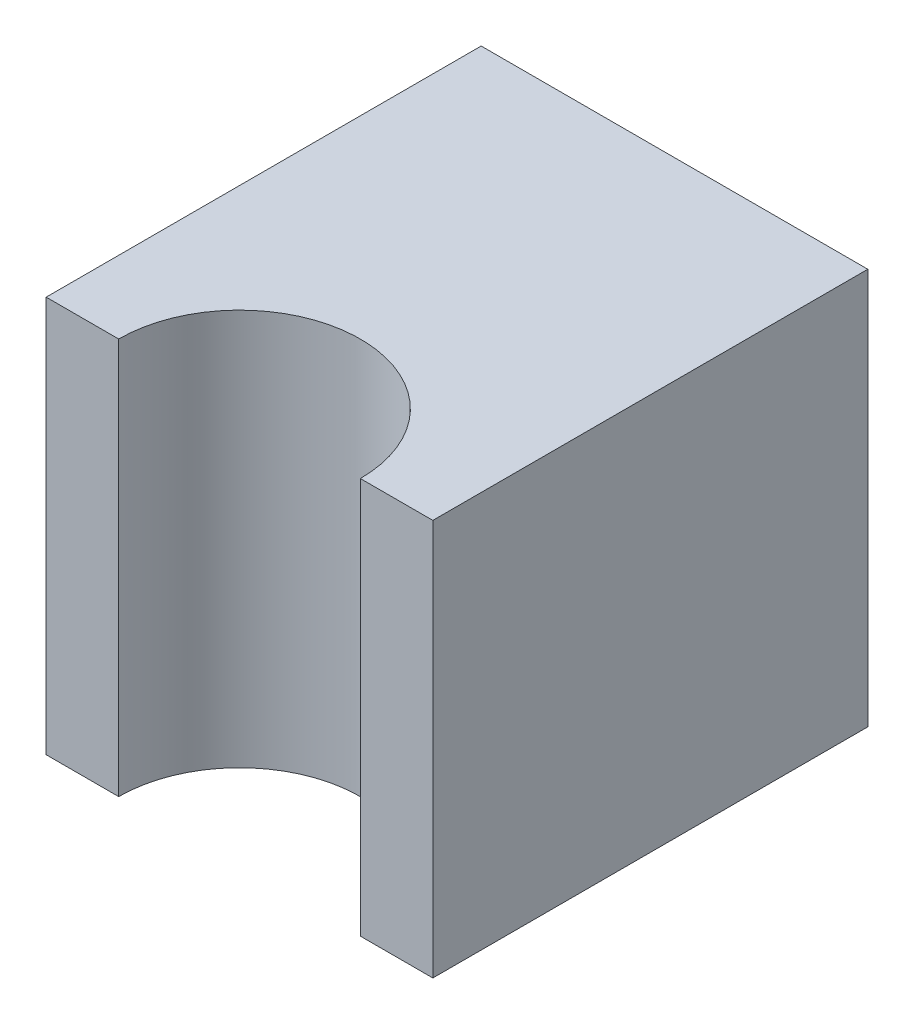
ISO-10303-21;
HEADER;
FILE_DESCRIPTION(('STEP AP214'),'2;1');
FILE_NAME('part.step','',(''),(''),'','','');
FILE_SCHEMA(('AUTOMOTIVE_DESIGN { 1 0 10303 214 1 1 1 1 }'));
ENDSEC;
DATA;
#1=APPLICATION_CONTEXT('core data for automotive mechanical design processes');
#2=APPLICATION_PROTOCOL_DEFINITION('international standard','automotive_design',2000,#1);
#3=PRODUCT_CONTEXT('',#1,'mechanical');
#4=PRODUCT('Part','Part','',(#3));
#5=PRODUCT_RELATED_PRODUCT_CATEGORY('part','',(#4));
#6=PRODUCT_DEFINITION_FORMATION('','',#4);
#7=PRODUCT_DEFINITION_CONTEXT('part definition',#1,'design');
#8=PRODUCT_DEFINITION('design','',#6,#7);
#9=PRODUCT_DEFINITION_SHAPE('','',#8);
#10=(LENGTH_UNIT() NAMED_UNIT(*) SI_UNIT(.MILLI.,.METRE.));
#11=(NAMED_UNIT(*) PLANE_ANGLE_UNIT() SI_UNIT($,.RADIAN.));
#12=(NAMED_UNIT(*) SI_UNIT($,.STERADIAN.) SOLID_ANGLE_UNIT());
#13=UNCERTAINTY_MEASURE_WITH_UNIT(LENGTH_MEASURE(1.E-05),#10,'distance_accuracy_value','');
#14=(GEOMETRIC_REPRESENTATION_CONTEXT(3) GLOBAL_UNCERTAINTY_ASSIGNED_CONTEXT((#13)) GLOBAL_UNIT_ASSIGNED_CONTEXT((#10,
#11,#12)) REPRESENTATION_CONTEXT('',''));
#15=CARTESIAN_POINT('',(0.,0.,0.));
#16=DIRECTION('',(0.,0.,1.));
#17=DIRECTION('',(1.,0.,0.));
#18=AXIS2_PLACEMENT_3D('',#15,#16,#17);
#19=CARTESIAN_POINT('',(-2.6,0.,6.1));
#20=DIRECTION('',(0.,1.,0.));
#21=DIRECTION('',(0.,0.,1.));
#22=AXIS2_PLACEMENT_3D('',#19,#20,#21);
#23=CYLINDRICAL_SURFACE('',#22,0.25);
#24=DIRECTION('',(0.,1.,0.));
#25=VECTOR('',#24,1.);
#26=CARTESIAN_POINT('',(-2.35,0.,6.1));
#27=LINE('',#26,#25);
#28=CARTESIAN_POINT('',(-2.35,0.82,6.1));
#29=VERTEX_POINT('',#28);
#30=CARTESIAN_POINT('',(-2.35,0.,6.1));
#31=VERTEX_POINT('',#30);
#32=EDGE_CURVE('E119',#29,#31,#27,.F.);
#33=ORIENTED_EDGE('',*,*,#32,.F.);
#34=CARTESIAN_POINT('',(-2.6,0.82,6.1));
#35=DIRECTION('',(0.,1.,0.));
#36=DIRECTION('',(0.,0.,1.));
#37=AXIS2_PLACEMENT_3D('',#34,#35,#36);
#38=CIRCLE('',#37,0.25);
#39=CARTESIAN_POINT('',(-2.85,0.82,6.1));
#40=VERTEX_POINT('',#39);
#41=EDGE_CURVE('E80',#40,#29,#38,.F.);
#42=ORIENTED_EDGE('',*,*,#41,.F.);
#43=DIRECTION('',(0.,1.,0.));
#44=VECTOR('',#43,1.);
#45=CARTESIAN_POINT('',(-2.85,0.,6.1));
#46=LINE('',#45,#44);
#47=CARTESIAN_POINT('',(-2.85,0.,6.1));
#48=VERTEX_POINT('',#47);
#49=EDGE_CURVE('E78',#48,#40,#46,.T.);
#50=ORIENTED_EDGE('',*,*,#49,.F.);
#51=CARTESIAN_POINT('',(-2.6,0.,6.1));
#52=DIRECTION('',(0.,1.,0.));
#53=DIRECTION('',(0.,0.,1.));
#54=AXIS2_PLACEMENT_3D('',#51,#52,#53);
#55=CIRCLE('',#54,0.25);
#56=EDGE_CURVE('E20',#48,#31,#55,.F.);
#57=ORIENTED_EDGE('',*,*,#56,.T.);
#58=EDGE_LOOP('',(#33,#42,#50,#57));
#59=FACE_BOUND('',#58,.T.);
#60=ADVANCED_FACE('F17',(#59),#23,.F.);
#61=CARTESIAN_POINT('',(-2.35,0.,6.1));
#62=DIRECTION('',(0.,0.,1.));
#63=DIRECTION('',(1.,0.,0.));
#64=AXIS2_PLACEMENT_3D('',#61,#62,#63);
#65=PLANE('',#64);
#66=DIRECTION('',(1.,0.,0.));
#67=VECTOR('',#66,1.);
#68=CARTESIAN_POINT('',(-2.6,0.82,6.1));
#69=LINE('',#68,#67);
#70=CARTESIAN_POINT('',(-2.2,0.82,6.1));
#71=VERTEX_POINT('',#70);
#72=EDGE_CURVE('E104',#29,#71,#69,.T.);
#73=ORIENTED_EDGE('',*,*,#72,.F.);
#74=ORIENTED_EDGE('',*,*,#32,.T.);
#75=DIRECTION('',(1.,0.,0.));
#76=VECTOR('',#75,1.);
#77=CARTESIAN_POINT('',(-2.6,0.,6.1));
#78=LINE('',#77,#76);
#79=CARTESIAN_POINT('',(-2.2,0.,6.1));
#80=VERTEX_POINT('',#79);
#81=EDGE_CURVE('E73',#31,#80,#78,.T.);
#82=ORIENTED_EDGE('',*,*,#81,.T.);
#83=DIRECTION('',(0.,1.,0.));
#84=VECTOR('',#83,1.);
#85=CARTESIAN_POINT('',(-2.2,0.,6.1));
#86=LINE('',#85,#84);
#87=EDGE_CURVE('E76',#71,#80,#86,.F.);
#88=ORIENTED_EDGE('',*,*,#87,.F.);
#89=EDGE_LOOP('',(#73,#74,#82,#88));
#90=FACE_BOUND('',#89,.T.);
#91=ADVANCED_FACE('F196',(#90),#65,.T.);
#92=CARTESIAN_POINT('',(-2.2,0.,6.1));
#93=DIRECTION('',(1.,0.,0.));
#94=DIRECTION('',(0.,0.,-1.));
#95=AXIS2_PLACEMENT_3D('',#92,#93,#94);
#96=PLANE('',#95);
#97=DIRECTION('',(0.,0.,1.));
#98=VECTOR('',#97,1.);
#99=CARTESIAN_POINT('',(-2.2,0.82,5.65));
#100=LINE('',#99,#98);
#101=CARTESIAN_POINT('',(-2.2,0.82,5.2));
#102=VERTEX_POINT('',#101);
#103=EDGE_CURVE('E83',#71,#102,#100,.F.);
#104=ORIENTED_EDGE('',*,*,#103,.F.);
#105=ORIENTED_EDGE('',*,*,#87,.T.);
#106=DIRECTION('',(0.,0.,1.));
#107=VECTOR('',#106,1.);
#108=CARTESIAN_POINT('',(-2.2,0.,5.65));
#109=LINE('',#108,#107);
#110=CARTESIAN_POINT('',(-2.2,0.,5.2));
#111=VERTEX_POINT('',#110);
#112=EDGE_CURVE('E89',#80,#111,#109,.F.);
#113=ORIENTED_EDGE('',*,*,#112,.T.);
#114=DIRECTION('',(0.,1.,0.));
#115=VECTOR('',#114,1.);
#116=CARTESIAN_POINT('',(-2.2,0.,5.2));
#117=LINE('',#116,#115);
#118=EDGE_CURVE('E100',#102,#111,#117,.F.);
#119=ORIENTED_EDGE('',*,*,#118,.F.);
#120=EDGE_LOOP('',(#104,#105,#113,#119));
#121=FACE_BOUND('',#120,.T.);
#122=ADVANCED_FACE('F187',(#121),#96,.T.);
#123=CARTESIAN_POINT('',(-2.6,0.,5.65));
#124=DIRECTION('',(0.,1.,0.));
#125=DIRECTION('',(0.,0.,1.));
#126=AXIS2_PLACEMENT_3D('',#123,#124,#125);
#127=PLANE('',#126);
#128=ORIENTED_EDGE('',*,*,#81,.F.);
#129=ORIENTED_EDGE('',*,*,#56,.F.);
#130=DIRECTION('',(1.,0.,0.));
#131=VECTOR('',#130,1.);
#132=CARTESIAN_POINT('',(-3.,0.,6.1));
#133=LINE('',#132,#131);
#134=CARTESIAN_POINT('',(-3.,0.,6.1));
#135=VERTEX_POINT('',#134);
#136=EDGE_CURVE('E70',#135,#48,#133,.T.);
#137=ORIENTED_EDGE('',*,*,#136,.F.);
#138=DIRECTION('',(0.,0.,1.));
#139=VECTOR('',#138,1.);
#140=CARTESIAN_POINT('',(-3.,0.,5.2));
#141=LINE('',#140,#139);
#142=CARTESIAN_POINT('',(-3.,0.,5.2));
#143=VERTEX_POINT('',#142);
#144=EDGE_CURVE('E98',#143,#135,#141,.T.);
#145=ORIENTED_EDGE('',*,*,#144,.F.);
#146=DIRECTION('',(-1.,0.,0.));
#147=VECTOR('',#146,1.);
#148=CARTESIAN_POINT('',(-2.2,0.,5.2));
#149=LINE('',#148,#147);
#150=EDGE_CURVE('E107',#111,#143,#149,.T.);
#151=ORIENTED_EDGE('',*,*,#150,.F.);
#152=ORIENTED_EDGE('',*,*,#112,.F.);
#153=EDGE_LOOP('',(#128,#129,#137,#145,#151,#152));
#154=FACE_BOUND('',#153,.T.);
#155=ADVANCED_FACE('F68',(#154),#127,.F.);
#156=CARTESIAN_POINT('',(-3.,0.,6.1));
#157=DIRECTION('',(0.,0.,1.));
#158=DIRECTION('',(1.,0.,0.));
#159=AXIS2_PLACEMENT_3D('',#156,#157,#158);
#160=PLANE('',#159);
#161=DIRECTION('',(1.,0.,0.));
#162=VECTOR('',#161,1.);
#163=CARTESIAN_POINT('',(-2.6,0.82,6.1));
#164=LINE('',#163,#162);
#165=CARTESIAN_POINT('',(-3.,0.82,6.1));
#166=VERTEX_POINT('',#165);
#167=EDGE_CURVE('E105',#166,#40,#164,.T.);
#168=ORIENTED_EDGE('',*,*,#167,.F.);
#169=DIRECTION('',(0.,1.,0.));
#170=VECTOR('',#169,1.);
#171=CARTESIAN_POINT('',(-3.,0.,6.1));
#172=LINE('',#171,#170);
#173=EDGE_CURVE('E87',#135,#166,#172,.T.);
#174=ORIENTED_EDGE('',*,*,#173,.F.);
#175=ORIENTED_EDGE('',*,*,#136,.T.);
#176=ORIENTED_EDGE('',*,*,#49,.T.);
#177=EDGE_LOOP('',(#168,#174,#175,#176));
#178=FACE_BOUND('',#177,.T.);
#179=ADVANCED_FACE('F85',(#178),#160,.T.);
#180=CARTESIAN_POINT('',(-2.6,0.82,5.65));
#181=DIRECTION('',(0.,1.,0.));
#182=DIRECTION('',(0.,0.,1.));
#183=AXIS2_PLACEMENT_3D('',#180,#181,#182);
#184=PLANE('',#183);
#185=ORIENTED_EDGE('',*,*,#41,.T.);
#186=ORIENTED_EDGE('',*,*,#72,.T.);
#187=ORIENTED_EDGE('',*,*,#103,.T.);
#188=DIRECTION('',(-1.,0.,0.));
#189=VECTOR('',#188,1.);
#190=CARTESIAN_POINT('',(-2.2,0.82,5.2));
#191=LINE('',#190,#189);
#192=CARTESIAN_POINT('',(-3.,0.82,5.2));
#193=VERTEX_POINT('',#192);
#194=EDGE_CURVE('E35',#193,#102,#191,.F.);
#195=ORIENTED_EDGE('',*,*,#194,.F.);
#196=DIRECTION('',(0.,0.,1.));
#197=VECTOR('',#196,1.);
#198=CARTESIAN_POINT('',(-3.,0.82,5.2));
#199=LINE('',#198,#197);
#200=EDGE_CURVE('E26',#166,#193,#199,.F.);
#201=ORIENTED_EDGE('',*,*,#200,.F.);
#202=ORIENTED_EDGE('',*,*,#167,.T.);
#203=EDGE_LOOP('',(#185,#186,#187,#195,#201,#202));
#204=FACE_BOUND('',#203,.T.);
#205=ADVANCED_FACE('F145',(#204),#184,.T.);
#206=CARTESIAN_POINT('',(-2.2,0.,5.2));
#207=DIRECTION('',(0.,0.,-1.));
#208=DIRECTION('',(-1.,0.,0.));
#209=AXIS2_PLACEMENT_3D('',#206,#207,#208);
#210=PLANE('',#209);
#211=ORIENTED_EDGE('',*,*,#194,.T.);
#212=ORIENTED_EDGE('',*,*,#118,.T.);
#213=ORIENTED_EDGE('',*,*,#150,.T.);
#214=DIRECTION('',(0.,1.,0.));
#215=VECTOR('',#214,1.);
#216=CARTESIAN_POINT('',(-3.,0.,5.2));
#217=LINE('',#216,#215);
#218=EDGE_CURVE('E11',#193,#143,#217,.F.);
#219=ORIENTED_EDGE('',*,*,#218,.F.);
#220=EDGE_LOOP('',(#211,#212,#213,#219));
#221=FACE_BOUND('',#220,.T.);
#222=ADVANCED_FACE('F141',(#221),#210,.T.);
#223=CARTESIAN_POINT('',(-3.,0.,5.2));
#224=DIRECTION('',(-1.,0.,0.));
#225=DIRECTION('',(0.,0.,1.));
#226=AXIS2_PLACEMENT_3D('',#223,#224,#225);
#227=PLANE('',#226);
#228=ORIENTED_EDGE('',*,*,#200,.T.);
#229=ORIENTED_EDGE('',*,*,#218,.T.);
#230=ORIENTED_EDGE('',*,*,#144,.T.);
#231=ORIENTED_EDGE('',*,*,#173,.T.);
#232=EDGE_LOOP('',(#228,#229,#230,#231));
#233=FACE_BOUND('',#232,.T.);
#234=ADVANCED_FACE('F144',(#233),#227,.T.);
#235=CLOSED_SHELL('',(#60,#91,#122,#155,#179,#205,#222,#234));
#236=MANIFOLD_SOLID_BREP('B1',#235);
#237=ADVANCED_BREP_SHAPE_REPRESENTATION('',(#18,#236),#14);
#238=SHAPE_DEFINITION_REPRESENTATION(#9,#237);
ENDSEC;
END-ISO-10303-21;
